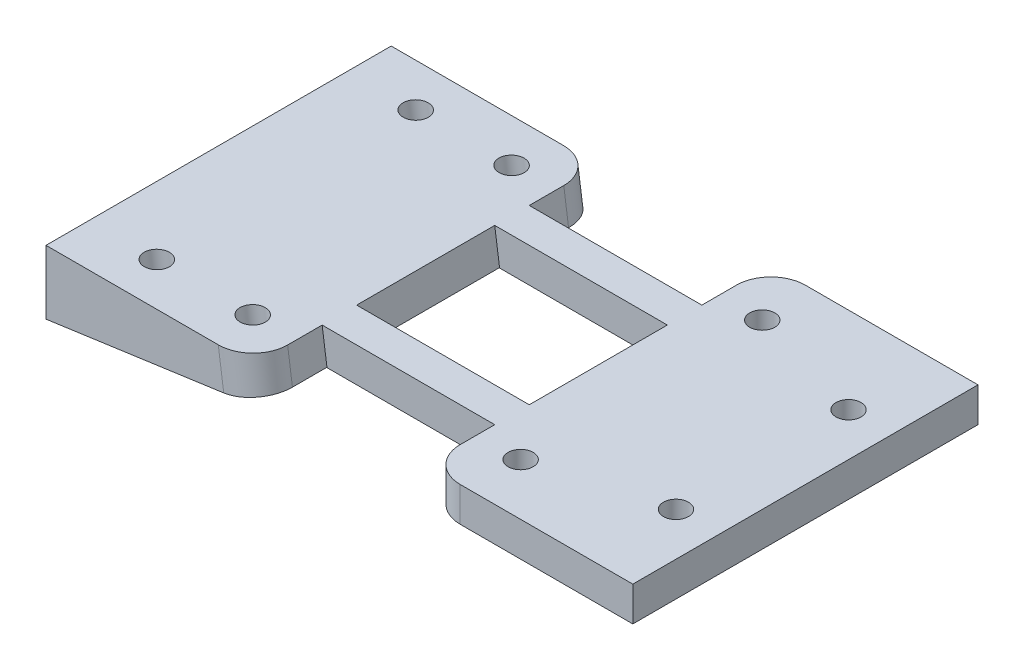
ISO-10303-21;
HEADER;
FILE_DESCRIPTION(('STEP AP214'),'2;1');
FILE_NAME('part.step','',(''),(''),'','','');
FILE_SCHEMA(('AUTOMOTIVE_DESIGN { 1 0 10303 214 1 1 1 1 }'));
ENDSEC;
DATA;
#1=APPLICATION_CONTEXT('core data for automotive mechanical design processes');
#2=APPLICATION_PROTOCOL_DEFINITION('international standard','automotive_design',2000,#1);
#3=PRODUCT_CONTEXT('',#1,'mechanical');
#4=PRODUCT('Part','Part','',(#3));
#5=PRODUCT_RELATED_PRODUCT_CATEGORY('part','',(#4));
#6=PRODUCT_DEFINITION_FORMATION('','',#4);
#7=PRODUCT_DEFINITION_CONTEXT('part definition',#1,'design');
#8=PRODUCT_DEFINITION('design','',#6,#7);
#9=PRODUCT_DEFINITION_SHAPE('','',#8);
#10=(LENGTH_UNIT() NAMED_UNIT(*) SI_UNIT(.MILLI.,.METRE.));
#11=(NAMED_UNIT(*) PLANE_ANGLE_UNIT() SI_UNIT($,.RADIAN.));
#12=(NAMED_UNIT(*) SI_UNIT($,.STERADIAN.) SOLID_ANGLE_UNIT());
#13=UNCERTAINTY_MEASURE_WITH_UNIT(LENGTH_MEASURE(1.E-05),#10,'distance_accuracy_value','');
#14=(GEOMETRIC_REPRESENTATION_CONTEXT(3) GLOBAL_UNCERTAINTY_ASSIGNED_CONTEXT((#13)) GLOBAL_UNIT_ASSIGNED_CONTEXT((#10,
#11,#12)) REPRESENTATION_CONTEXT('',''));
#15=CARTESIAN_POINT('',(0.,0.,0.));
#16=DIRECTION('',(0.,0.,1.));
#17=DIRECTION('',(1.,0.,0.));
#18=AXIS2_PLACEMENT_3D('',#15,#16,#17);
#19=CARTESIAN_POINT('',(17.,-1.99999999999991,10.));
#20=DIRECTION('',(0.,1.,0.));
#21=DIRECTION('',(-1.,0.,0.));
#22=AXIS2_PLACEMENT_3D('',#19,#20,#21);
#23=PLANE('',#22);
#24=CARTESIAN_POINT('',(14.5,-1.99999999999993,5.));
#25=DIRECTION('',(0.,1.,0.));
#26=DIRECTION('',(1.,0.,0.));
#27=AXIS2_PLACEMENT_3D('',#24,#25,#26);
#28=CIRCLE('',#27,0.725);
#29=CARTESIAN_POINT('',(15.225,-1.99999999999993,5.));
#30=VERTEX_POINT('',#29);
#31=EDGE_CURVE('E744',#30,#30,#28,.T.);
#32=ORIENTED_EDGE('',*,*,#31,.T.);
#33=EDGE_LOOP('',(#32));
#34=FACE_BOUND('',#33,.T.);
#35=CARTESIAN_POINT('',(7.50000000000001,-1.99999999999998,-7.));
#36=DIRECTION('',(0.,1.,0.));
#37=DIRECTION('',(-1.,0.,0.));
#38=AXIS2_PLACEMENT_3D('',#35,#36,#37);
#39=CIRCLE('',#38,0.724999999999999);
#40=CARTESIAN_POINT('',(6.77500000000002,-1.99999999999999,-7.));
#41=VERTEX_POINT('',#40);
#42=EDGE_CURVE('E219',#41,#41,#39,.T.);
#43=ORIENTED_EDGE('',*,*,#42,.T.);
#44=EDGE_LOOP('',(#43));
#45=FACE_BOUND('',#44,.T.);
#46=DIRECTION('',(1.,0.,0.));
#47=VECTOR('',#46,1.);
#48=CARTESIAN_POINT('',(17.,-1.99999999999991,10.));
#49=LINE('',#48,#47);
#50=CARTESIAN_POINT('',(7.00000000000002,-1.99999999999999,10.));
#51=VERTEX_POINT('',#50);
#52=CARTESIAN_POINT('',(17.,-1.99999999999991,10.));
#53=VERTEX_POINT('',#52);
#54=EDGE_CURVE('E284',#51,#53,#49,.T.);
#55=ORIENTED_EDGE('',*,*,#54,.F.);
#56=CARTESIAN_POINT('',(7.00000000000002,-1.99999999999999,8.));
#57=DIRECTION('',(0.,1.,0.));
#58=DIRECTION('',(-1.,0.,0.));
#59=AXIS2_PLACEMENT_3D('',#56,#57,#58);
#60=CIRCLE('',#59,2.);
#61=CARTESIAN_POINT('',(5.00000000000002,-2.,8.));
#62=VERTEX_POINT('',#61);
#63=EDGE_CURVE('E323',#51,#62,#60,.F.);
#64=ORIENTED_EDGE('',*,*,#63,.T.);
#65=DIRECTION('',(0.,0.,-1.));
#66=VECTOR('',#65,1.);
#67=CARTESIAN_POINT('',(5.00000000000002,-2.,10.));
#68=LINE('',#67,#66);
#69=CARTESIAN_POINT('',(5.00000000000002,-2.,6.));
#70=VERTEX_POINT('',#69);
#71=EDGE_CURVE('E307',#62,#70,#68,.T.);
#72=ORIENTED_EDGE('',*,*,#71,.T.);
#73=DIRECTION('',(-1.,0.,0.));
#74=VECTOR('',#73,1.);
#75=CARTESIAN_POINT('',(6.,-2.,6.));
#76=LINE('',#75,#74);
#77=CARTESIAN_POINT('',(-4.860146376113,-2.,6.));
#78=VERTEX_POINT('',#77);
#79=EDGE_CURVE('E216',#70,#78,#76,.T.);
#80=ORIENTED_EDGE('',*,*,#79,.T.);
#81=DIRECTION('',(0.,0.,-1.));
#82=VECTOR('',#81,1.);
#83=CARTESIAN_POINT('',(-4.860146376113,-2.,10.));
#84=LINE('',#83,#82);
#85=CARTESIAN_POINT('',(-4.860146376113,-2.,4.));
#86=VERTEX_POINT('',#85);
#87=EDGE_CURVE('E315',#78,#86,#84,.T.);
#88=ORIENTED_EDGE('',*,*,#87,.T.);
#89=DIRECTION('',(-1.,0.,0.));
#90=VECTOR('',#89,1.);
#91=CARTESIAN_POINT('',(6.,-2.,4.));
#92=LINE('',#91,#90);
#93=CARTESIAN_POINT('',(5.00000000000001,-2.,4.));
#94=VERTEX_POINT('',#93);
#95=EDGE_CURVE('E213',#94,#86,#92,.T.);
#96=ORIENTED_EDGE('',*,*,#95,.F.);
#97=CARTESIAN_POINT('',(5.00000000000002,-2.,-4.));
#98=VERTEX_POINT('',#97);
#99=EDGE_CURVE('E309',#94,#98,#68,.T.);
#100=ORIENTED_EDGE('',*,*,#99,.T.);
#101=DIRECTION('',(-1.,0.,0.));
#102=VECTOR('',#101,1.);
#103=CARTESIAN_POINT('',(6.,-2.,-4.));
#104=LINE('',#103,#102);
#105=CARTESIAN_POINT('',(-4.860146376113,-2.,-4.));
#106=VERTEX_POINT('',#105);
#107=EDGE_CURVE('E269',#98,#106,#104,.T.);
#108=ORIENTED_EDGE('',*,*,#107,.T.);
#109=DIRECTION('',(0.,0.,1.));
#110=VECTOR('',#109,1.);
#111=CARTESIAN_POINT('',(-4.8601463761135,-2.00000000000007,10.));
#112=LINE('',#111,#110);
#113=CARTESIAN_POINT('',(-4.8601463761135,-2.00000000000007,-6.));
#114=VERTEX_POINT('',#113);
#115=EDGE_CURVE('E262',#114,#106,#112,.T.);
#116=ORIENTED_EDGE('',*,*,#115,.F.);
#117=DIRECTION('',(-1.,0.,0.));
#118=VECTOR('',#117,1.);
#119=CARTESIAN_POINT('',(6.,-2.,-6.));
#120=LINE('',#119,#118);
#121=CARTESIAN_POINT('',(5.00000000000002,-2.,-6.));
#122=VERTEX_POINT('',#121);
#123=EDGE_CURVE('E266',#122,#114,#120,.T.);
#124=ORIENTED_EDGE('',*,*,#123,.F.);
#125=CARTESIAN_POINT('',(5.00000000000002,-2.,-8.));
#126=VERTEX_POINT('',#125);
#127=EDGE_CURVE('E306',#122,#126,#68,.T.);
#128=ORIENTED_EDGE('',*,*,#127,.T.);
#129=CARTESIAN_POINT('',(7.00000000000002,-1.99999999999999,-8.));
#130=DIRECTION('',(0.,1.,0.));
#131=DIRECTION('',(-1.,0.,0.));
#132=AXIS2_PLACEMENT_3D('',#129,#130,#131);
#133=CIRCLE('',#132,2.);
#134=CARTESIAN_POINT('',(7.00000000000002,-1.99999999999999,-10.));
#135=VERTEX_POINT('',#134);
#136=EDGE_CURVE('E321',#126,#135,#133,.F.);
#137=ORIENTED_EDGE('',*,*,#136,.T.);
#138=DIRECTION('',(1.,0.,0.));
#139=VECTOR('',#138,1.);
#140=CARTESIAN_POINT('',(17.,-1.99999999999991,-10.));
#141=LINE('',#140,#139);
#142=CARTESIAN_POINT('',(17.,-1.99999999999991,-10.));
#143=VERTEX_POINT('',#142);
#144=EDGE_CURVE('E283',#135,#143,#141,.T.);
#145=ORIENTED_EDGE('',*,*,#144,.T.);
#146=DIRECTION('',(0.,0.,-1.));
#147=VECTOR('',#146,1.);
#148=CARTESIAN_POINT('',(17.,-1.99999999999991,10.));
#149=LINE('',#148,#147);
#150=EDGE_CURVE('E303',#53,#143,#149,.T.);
#151=ORIENTED_EDGE('',*,*,#150,.F.);
#152=EDGE_LOOP('',(#55,#64,#72,#80,#88,#96,#100,#108,#116,#124,#128,#137,#145,#151));
#153=FACE_BOUND('',#152,.T.);
#154=CARTESIAN_POINT('',(14.5,-1.99999999999993,-5.));
#155=DIRECTION('',(0.,1.,0.));
#156=DIRECTION('',(-1.,0.,0.));
#157=AXIS2_PLACEMENT_3D('',#154,#155,#156);
#158=CIRCLE('',#157,0.725);
#159=CARTESIAN_POINT('',(13.775,-1.99999999999994,-5.));
#160=VERTEX_POINT('',#159);
#161=EDGE_CURVE('E750',#160,#160,#158,.T.);
#162=ORIENTED_EDGE('',*,*,#161,.T.);
#163=EDGE_LOOP('',(#162));
#164=FACE_BOUND('',#163,.T.);
#165=CARTESIAN_POINT('',(7.50000000000001,-1.99999999999998,7.));
#166=DIRECTION('',(0.,1.,0.));
#167=DIRECTION('',(1.,0.,0.));
#168=AXIS2_PLACEMENT_3D('',#165,#166,#167);
#169=CIRCLE('',#168,0.724999999999999);
#170=CARTESIAN_POINT('',(8.22500000000001,-1.99999999999998,7.));
#171=VERTEX_POINT('',#170);
#172=EDGE_CURVE('E740',#171,#171,#169,.T.);
#173=ORIENTED_EDGE('',*,*,#172,.T.);
#174=EDGE_LOOP('',(#173));
#175=FACE_BOUND('',#174,.T.);
#176=ADVANCED_FACE('F36',(#34,#45,#153,#164,#175),#23,.F.);
#177=CARTESIAN_POINT('',(5.,0.,10.));
#178=DIRECTION('',(0.,-1.,0.));
#179=DIRECTION('',(0.,0.,-1.));
#180=AXIS2_PLACEMENT_3D('',#177,#178,#179);
#181=PLANE('',#180);
#182=CARTESIAN_POINT('',(-7.52456893129654,0.,-7.5));
#183=DIRECTION('',(0.,-1.,0.));
#184=DIRECTION('',(1.,0.,0.));
#185=AXIS2_PLACEMENT_3D('',#182,#183,#184);
#186=ELLIPSE('',#185,0.732124990075997,0.725);
#187=CARTESIAN_POINT('',(-6.79244394122055,0.,-7.5));
#188=VERTEX_POINT('',#187);
#189=EDGE_CURVE('E718',#188,#188,#186,.T.);
#190=ORIENTED_EDGE('',*,*,#189,.T.);
#191=EDGE_LOOP('',(#190));
#192=FACE_BOUND('',#191,.T.);
#193=CARTESIAN_POINT('',(-13.0786205801489,0.,-7.5));
#194=DIRECTION('',(0.,-1.,0.));
#195=DIRECTION('',(1.,0.,0.));
#196=AXIS2_PLACEMENT_3D('',#193,#194,#195);
#197=ELLIPSE('',#196,0.732124990075999,0.725000000000001);
#198=CARTESIAN_POINT('',(-12.3464955900729,0.,-7.5));
#199=VERTEX_POINT('',#198);
#200=EDGE_CURVE('E722',#199,#199,#197,.T.);
#201=ORIENTED_EDGE('',*,*,#200,.T.);
#202=EDGE_LOOP('',(#201));
#203=FACE_BOUND('',#202,.T.);
#204=CARTESIAN_POINT('',(-13.0786205801489,0.,7.5));
#205=DIRECTION('',(0.,-1.,0.));
#206=DIRECTION('',(1.,0.,0.));
#207=AXIS2_PLACEMENT_3D('',#204,#205,#206);
#208=ELLIPSE('',#207,0.732124990075999,0.725000000000001);
#209=CARTESIAN_POINT('',(-12.3464955900729,0.,7.5));
#210=VERTEX_POINT('',#209);
#211=EDGE_CURVE('E731',#210,#210,#208,.T.);
#212=ORIENTED_EDGE('',*,*,#211,.T.);
#213=EDGE_LOOP('',(#212));
#214=FACE_BOUND('',#213,.T.);
#215=CARTESIAN_POINT('',(-7.52456893129654,0.,7.5));
#216=DIRECTION('',(0.,-1.,0.));
#217=DIRECTION('',(1.,0.,0.));
#218=AXIS2_PLACEMENT_3D('',#215,#216,#217);
#219=ELLIPSE('',#218,0.732124990075997,0.725);
#220=CARTESIAN_POINT('',(-6.79244394122055,0.,7.5));
#221=VERTEX_POINT('',#220);
#222=EDGE_CURVE('E737',#221,#221,#219,.T.);
#223=ORIENTED_EDGE('',*,*,#222,.T.);
#224=EDGE_LOOP('',(#223));
#225=FACE_BOUND('',#224,.T.);
#226=CARTESIAN_POINT('',(14.5,2.27682456221956E-13,5.));
#227=DIRECTION('',(0.,1.,0.));
#228=DIRECTION('',(1.,0.,0.));
#229=AXIS2_PLACEMENT_3D('',#226,#227,#228);
#230=CIRCLE('',#229,0.725);
#231=CARTESIAN_POINT('',(15.225,2.32914382225502E-13,5.));
#232=VERTEX_POINT('',#231);
#233=EDGE_CURVE('E747',#232,#232,#230,.T.);
#234=ORIENTED_EDGE('',*,*,#233,.F.);
#235=EDGE_LOOP('',(#234));
#236=FACE_BOUND('',#235,.T.);
#237=CARTESIAN_POINT('',(7.5,1.76941794549634E-13,-7.));
#238=DIRECTION('',(0.,1.,0.));
#239=DIRECTION('',(-1.,0.,0.));
#240=AXIS2_PLACEMENT_3D('',#237,#238,#239);
#241=CIRCLE('',#240,0.724999999999999);
#242=CARTESIAN_POINT('',(6.775,1.71709868546088E-13,-7.));
#243=VERTEX_POINT('',#242);
#244=EDGE_CURVE('E214',#243,#243,#241,.T.);
#245=ORIENTED_EDGE('',*,*,#244,.F.);
#246=EDGE_LOOP('',(#245));
#247=FACE_BOUND('',#246,.T.);
#248=DIRECTION('',(0.,0.,-1.));
#249=VECTOR('',#248,1.);
#250=CARTESIAN_POINT('',(5.,0.,10.));
#251=LINE('',#250,#249);
#252=CARTESIAN_POINT('',(5.,0.,4.));
#253=VERTEX_POINT('',#252);
#254=CARTESIAN_POINT('',(5.,0.,-4.));
#255=VERTEX_POINT('',#254);
#256=EDGE_CURVE('E212',#253,#255,#251,.T.);
#257=ORIENTED_EDGE('',*,*,#256,.F.);
#258=DIRECTION('',(-1.,0.,0.));
#259=VECTOR('',#258,1.);
#260=CARTESIAN_POINT('',(6.,0.,4.));
#261=LINE('',#260,#259);
#262=CARTESIAN_POINT('',(-5.,0.,4.));
#263=VERTEX_POINT('',#262);
#264=EDGE_CURVE('E203',#253,#263,#261,.T.);
#265=ORIENTED_EDGE('',*,*,#264,.T.);
#266=DIRECTION('',(0.,0.,-1.));
#267=VECTOR('',#266,1.);
#268=CARTESIAN_POINT('',(-5.,0.,10.));
#269=LINE('',#268,#267);
#270=CARTESIAN_POINT('',(-5.,0.,-4.));
#271=VERTEX_POINT('',#270);
#272=EDGE_CURVE('E184',#263,#271,#269,.T.);
#273=ORIENTED_EDGE('',*,*,#272,.T.);
#274=DIRECTION('',(-1.,0.,0.));
#275=VECTOR('',#274,1.);
#276=CARTESIAN_POINT('',(6.,0.,-4.));
#277=LINE('',#276,#275);
#278=EDGE_CURVE('E272',#255,#271,#277,.T.);
#279=ORIENTED_EDGE('',*,*,#278,.F.);
#280=EDGE_LOOP('',(#257,#265,#273,#279));
#281=FACE_BOUND('',#280,.T.);
#282=CARTESIAN_POINT('',(-5.,0.,-6.));
#283=VERTEX_POINT('',#282);
#284=CARTESIAN_POINT('',(-5.,0.,-8.));
#285=VERTEX_POINT('',#284);
#286=EDGE_CURVE('E196',#283,#285,#269,.T.);
#287=ORIENTED_EDGE('',*,*,#286,.T.);
#288=CARTESIAN_POINT('',(-7.01965514503723,0.,-8.));
#289=DIRECTION('',(0.,-1.,0.));
#290=DIRECTION('',(-1.,0.,0.));
#291=AXIS2_PLACEMENT_3D('',#288,#289,#290);
#292=ELLIPSE('',#291,2.01965514503723,2.);
#293=CARTESIAN_POINT('',(-7.01965514503723,0.,-10.));
#294=VERTEX_POINT('',#293);
#295=EDGE_CURVE('E341',#285,#294,#292,.F.);
#296=ORIENTED_EDGE('',*,*,#295,.T.);
#297=DIRECTION('',(-1.,0.,0.));
#298=VECTOR('',#297,1.);
#299=CARTESIAN_POINT('',(-5.,0.,-10.));
#300=LINE('',#299,#298);
#301=CARTESIAN_POINT('',(-17.,0.,-10.));
#302=VERTEX_POINT('',#301);
#303=EDGE_CURVE('E248',#294,#302,#300,.T.);
#304=ORIENTED_EDGE('',*,*,#303,.T.);
#305=DIRECTION('',(0.,0.,-1.));
#306=VECTOR('',#305,1.);
#307=CARTESIAN_POINT('',(-17.,0.,10.));
#308=LINE('',#307,#306);
#309=CARTESIAN_POINT('',(-17.,0.,10.));
#310=VERTEX_POINT('',#309);
#311=EDGE_CURVE('E253',#310,#302,#308,.T.);
#312=ORIENTED_EDGE('',*,*,#311,.F.);
#313=DIRECTION('',(-1.,0.,0.));
#314=VECTOR('',#313,1.);
#315=CARTESIAN_POINT('',(-5.,0.,10.));
#316=LINE('',#315,#314);
#317=CARTESIAN_POINT('',(-7.01965514503723,0.,10.));
#318=VERTEX_POINT('',#317);
#319=EDGE_CURVE('E240',#318,#310,#316,.T.);
#320=ORIENTED_EDGE('',*,*,#319,.F.);
#321=CARTESIAN_POINT('',(-7.01965514503723,0.,8.));
#322=DIRECTION('',(0.,-1.,0.));
#323=DIRECTION('',(1.,0.,0.));
#324=AXIS2_PLACEMENT_3D('',#321,#322,#323);
#325=ELLIPSE('',#324,2.01965514503723,2.);
#326=CARTESIAN_POINT('',(-5.,0.,8.));
#327=VERTEX_POINT('',#326);
#328=EDGE_CURVE('E339',#318,#327,#325,.F.);
#329=ORIENTED_EDGE('',*,*,#328,.T.);
#330=CARTESIAN_POINT('',(-5.,0.,6.));
#331=VERTEX_POINT('',#330);
#332=EDGE_CURVE('E195',#327,#331,#269,.T.);
#333=ORIENTED_EDGE('',*,*,#332,.T.);
#334=DIRECTION('',(-1.,0.,0.));
#335=VECTOR('',#334,1.);
#336=CARTESIAN_POINT('',(6.,0.,6.));
#337=LINE('',#336,#335);
#338=CARTESIAN_POINT('',(5.,0.,6.));
#339=VERTEX_POINT('',#338);
#340=EDGE_CURVE('E225',#339,#331,#337,.T.);
#341=ORIENTED_EDGE('',*,*,#340,.F.);
#342=CARTESIAN_POINT('',(5.,0.,8.));
#343=VERTEX_POINT('',#342);
#344=EDGE_CURVE('E298',#343,#339,#251,.T.);
#345=ORIENTED_EDGE('',*,*,#344,.F.);
#346=CARTESIAN_POINT('',(7.,0.,8.));
#347=DIRECTION('',(0.,-1.,0.));
#348=DIRECTION('',(0.,0.,-1.));
#349=AXIS2_PLACEMENT_3D('',#346,#347,#348);
#350=CIRCLE('',#349,2.);
#351=CARTESIAN_POINT('',(7.,0.,10.));
#352=VERTEX_POINT('',#351);
#353=EDGE_CURVE('E329',#343,#352,#350,.F.);
#354=ORIENTED_EDGE('',*,*,#353,.T.);
#355=DIRECTION('',(-1.,0.,0.));
#356=VECTOR('',#355,1.);
#357=CARTESIAN_POINT('',(5.,0.,10.));
#358=LINE('',#357,#356);
#359=CARTESIAN_POINT('',(17.,0.,10.));
#360=VERTEX_POINT('',#359);
#361=EDGE_CURVE('E289',#360,#352,#358,.T.);
#362=ORIENTED_EDGE('',*,*,#361,.F.);
#363=DIRECTION('',(0.,0.,-1.));
#364=VECTOR('',#363,1.);
#365=CARTESIAN_POINT('',(17.,0.,10.));
#366=LINE('',#365,#364);
#367=CARTESIAN_POINT('',(17.,0.,-10.));
#368=VERTEX_POINT('',#367);
#369=EDGE_CURVE('E300',#360,#368,#366,.T.);
#370=ORIENTED_EDGE('',*,*,#369,.T.);
#371=DIRECTION('',(-1.,0.,0.));
#372=VECTOR('',#371,1.);
#373=CARTESIAN_POINT('',(5.,0.,-10.));
#374=LINE('',#373,#372);
#375=CARTESIAN_POINT('',(7.,0.,-10.));
#376=VERTEX_POINT('',#375);
#377=EDGE_CURVE('E287',#368,#376,#374,.T.);
#378=ORIENTED_EDGE('',*,*,#377,.T.);
#379=CARTESIAN_POINT('',(7.,0.,-8.));
#380=DIRECTION('',(0.,-1.,0.));
#381=DIRECTION('',(0.,0.,-1.));
#382=AXIS2_PLACEMENT_3D('',#379,#380,#381);
#383=CIRCLE('',#382,2.);
#384=CARTESIAN_POINT('',(5.,0.,-8.));
#385=VERTEX_POINT('',#384);
#386=EDGE_CURVE('E327',#376,#385,#383,.F.);
#387=ORIENTED_EDGE('',*,*,#386,.T.);
#388=CARTESIAN_POINT('',(5.,0.,-6.));
#389=VERTEX_POINT('',#388);
#390=EDGE_CURVE('E292',#389,#385,#251,.T.);
#391=ORIENTED_EDGE('',*,*,#390,.F.);
#392=DIRECTION('',(-1.,0.,0.));
#393=VECTOR('',#392,1.);
#394=CARTESIAN_POINT('',(6.,0.,-6.));
#395=LINE('',#394,#393);
#396=EDGE_CURVE('E274',#389,#283,#395,.T.);
#397=ORIENTED_EDGE('',*,*,#396,.T.);
#398=EDGE_LOOP('',(#287,#296,#304,#312,#320,#329,#333,#341,#345,#354,#362,#370,#378,#387,#391,#397));
#399=FACE_BOUND('',#398,.T.);
#400=CARTESIAN_POINT('',(14.5,2.27682456221956E-13,-5.));
#401=DIRECTION('',(0.,1.,0.));
#402=DIRECTION('',(-1.,0.,0.));
#403=AXIS2_PLACEMENT_3D('',#400,#401,#402);
#404=CIRCLE('',#403,0.725);
#405=CARTESIAN_POINT('',(13.775,2.2245053021841E-13,-5.));
#406=VERTEX_POINT('',#405);
#407=EDGE_CURVE('E752',#406,#406,#404,.T.);
#408=ORIENTED_EDGE('',*,*,#407,.F.);
#409=EDGE_LOOP('',(#408));
#410=FACE_BOUND('',#409,.T.);
#411=CARTESIAN_POINT('',(7.5,1.76941794549634E-13,7.));
#412=DIRECTION('',(0.,1.,0.));
#413=DIRECTION('',(1.,0.,0.));
#414=AXIS2_PLACEMENT_3D('',#411,#412,#413);
#415=CIRCLE('',#414,0.724999999999999);
#416=CARTESIAN_POINT('',(8.225,1.8217372055318E-13,7.));
#417=VERTEX_POINT('',#416);
#418=EDGE_CURVE('E741',#417,#417,#415,.T.);
#419=ORIENTED_EDGE('',*,*,#418,.F.);
#420=EDGE_LOOP('',(#419));
#421=FACE_BOUND('',#420,.T.);
#422=ADVANCED_FACE('F210',(#192,#203,#214,#225,#236,#247,#281,#399,#410,#421),#181,.F.);
#423=CARTESIAN_POINT('',(5.,0.,10.));
#424=DIRECTION('',(1.,0.,0.));
#425=DIRECTION('',(0.,1.,0.));
#426=AXIS2_PLACEMENT_3D('',#423,#424,#425);
#427=PLANE('',#426);
#428=ORIENTED_EDGE('',*,*,#71,.F.);
#429=DIRECTION('',(0.,-1.,0.));
#430=VECTOR('',#429,1.);
#431=CARTESIAN_POINT('',(5.,0.,8.));
#432=LINE('',#431,#430);
#433=EDGE_CURVE('E325',#62,#343,#432,.F.);
#434=ORIENTED_EDGE('',*,*,#433,.T.);
#435=ORIENTED_EDGE('',*,*,#344,.T.);
#436=DIRECTION('',(0.,1.,0.));
#437=VECTOR('',#436,1.);
#438=CARTESIAN_POINT('',(5.,0.,6.));
#439=LINE('',#438,#437);
#440=EDGE_CURVE('E234',#70,#339,#439,.T.);
#441=ORIENTED_EDGE('',*,*,#440,.F.);
#442=EDGE_LOOP('',(#428,#434,#435,#441));
#443=FACE_BOUND('',#442,.T.);
#444=ADVANCED_FACE('F376',(#443),#427,.F.);
#445=DIRECTION('',(0.,-1.,0.));
#446=VECTOR('',#445,1.);
#447=CARTESIAN_POINT('',(5.,0.,4.));
#448=LINE('',#447,#446);
#449=EDGE_CURVE('E229',#253,#94,#448,.T.);
#450=ORIENTED_EDGE('',*,*,#449,.F.);
#451=ORIENTED_EDGE('',*,*,#256,.T.);
#452=DIRECTION('',(0.,1.,0.));
#453=VECTOR('',#452,1.);
#454=CARTESIAN_POINT('',(5.,0.,-4.));
#455=LINE('',#454,#453);
#456=EDGE_CURVE('E277',#98,#255,#455,.T.);
#457=ORIENTED_EDGE('',*,*,#456,.F.);
#458=ORIENTED_EDGE('',*,*,#99,.F.);
#459=EDGE_LOOP('',(#450,#451,#457,#458));
#460=FACE_BOUND('',#459,.T.);
#461=ADVANCED_FACE('F367',(#460),#427,.F.);
#462=CARTESIAN_POINT('',(-17.,-3.70614516146585,10.));
#463=DIRECTION('',(-0.139173100960059,0.990268068741571,0.));
#464=DIRECTION('',(-0.990268068741571,-0.139173100960059,0.));
#465=AXIS2_PLACEMENT_3D('',#462,#463,#464);
#466=PLANE('',#465);
#467=CARTESIAN_POINT('',(-7.19732396993381,-2.32846888988329,-7.5));
#468=DIRECTION('',(0.139173100960059,-0.990268068741571,0.));
#469=DIRECTION('',(-0.990268068741571,-0.139173100960059,0.));
#470=AXIS2_PLACEMENT_3D('',#467,#468,#469);
#471=CIRCLE('',#470,0.725);
#472=CARTESIAN_POINT('',(-7.91526831977145,-2.42936938807933,-7.5));
#473=VERTEX_POINT('',#472);
#474=EDGE_CURVE('E715',#473,#473,#471,.T.);
#475=ORIENTED_EDGE('',*,*,#474,.F.);
#476=EDGE_LOOP('',(#475));
#477=FACE_BOUND('',#476,.T.);
#478=CARTESIAN_POINT('',(-12.6437983480125,-3.09392094516361,-7.5));
#479=DIRECTION('',(0.139173100960059,-0.990268068741571,0.));
#480=DIRECTION('',(-0.990268068741571,-0.139173100960059,0.));
#481=AXIS2_PLACEMENT_3D('',#478,#479,#480);
#482=CIRCLE('',#481,0.725000000000001);
#483=CARTESIAN_POINT('',(-13.3617426978501,-3.19482144335965,-7.5));
#484=VERTEX_POINT('',#483);
#485=EDGE_CURVE('E719',#484,#484,#482,.T.);
#486=ORIENTED_EDGE('',*,*,#485,.F.);
#487=EDGE_LOOP('',(#486));
#488=FACE_BOUND('',#487,.T.);
#489=CARTESIAN_POINT('',(-12.6437983480125,-3.09392094516361,7.5));
#490=DIRECTION('',(0.139173100960059,-0.990268068741571,0.));
#491=DIRECTION('',(0.990268068741571,0.139173100960059,0.));
#492=AXIS2_PLACEMENT_3D('',#489,#490,#491);
#493=CIRCLE('',#492,0.725000000000001);
#494=CARTESIAN_POINT('',(-11.9258539981748,-2.99302044696757,7.5));
#495=VERTEX_POINT('',#494);
#496=EDGE_CURVE('E728',#495,#495,#493,.T.);
#497=ORIENTED_EDGE('',*,*,#496,.F.);
#498=EDGE_LOOP('',(#497));
#499=FACE_BOUND('',#498,.T.);
#500=CARTESIAN_POINT('',(-7.19732396993381,-2.32846888988329,7.5));
#501=DIRECTION('',(0.139173100960059,-0.990268068741571,0.));
#502=DIRECTION('',(0.990268068741571,0.139173100960059,0.));
#503=AXIS2_PLACEMENT_3D('',#500,#501,#502);
#504=CIRCLE('',#503,0.725);
#505=CARTESIAN_POINT('',(-6.47937962009617,-2.22756839168725,7.5));
#506=VERTEX_POINT('',#505);
#507=EDGE_CURVE('E734',#506,#506,#504,.T.);
#508=ORIENTED_EDGE('',*,*,#507,.F.);
#509=EDGE_LOOP('',(#508));
#510=FACE_BOUND('',#509,.T.);
#511=DIRECTION('',(0.990268068741571,0.139173100960059,0.));
#512=VECTOR('',#511,1.);
#513=CARTESIAN_POINT('',(-17.,-3.70614516146585,-10.));
#514=LINE('',#513,#512);
#515=CARTESIAN_POINT('',(-17.,-3.70614516146585,-10.));
#516=VERTEX_POINT('',#515);
#517=CARTESIAN_POINT('',(-6.70218993556303,-2.25888233940326,-10.));
#518=VERTEX_POINT('',#517);
#519=EDGE_CURVE('E237',#516,#518,#514,.T.);
#520=ORIENTED_EDGE('',*,*,#519,.T.);
#521=CARTESIAN_POINT('',(-6.70218993556302,-2.25888233940326,-8.));
#522=DIRECTION('',(-0.139173100960059,0.990268068741571,0.));
#523=DIRECTION('',(-0.990268068741571,-0.139173100960059,0.));
#524=AXIS2_PLACEMENT_3D('',#521,#522,#523);
#525=CIRCLE('',#524,2.);
#526=CARTESIAN_POINT('',(-4.72165379807988,-1.98053613748314,-8.));
#527=VERTEX_POINT('',#526);
#528=EDGE_CURVE('E346',#518,#527,#525,.F.);
#529=ORIENTED_EDGE('',*,*,#528,.T.);
#530=DIRECTION('',(0.,0.,-1.));
#531=VECTOR('',#530,1.);
#532=CARTESIAN_POINT('',(-4.72165379807988,-1.98053613748314,10.));
#533=LINE('',#532,#531);
#534=CARTESIAN_POINT('',(-4.72165379807988,-1.98053613748314,-6.));
#535=VERTEX_POINT('',#534);
#536=EDGE_CURVE('E256',#535,#527,#533,.T.);
#537=ORIENTED_EDGE('',*,*,#536,.F.);
#538=DIRECTION('',(-0.990268068741571,-0.139173100960059,0.));
#539=VECTOR('',#538,1.);
#540=CARTESIAN_POINT('',(6.06528552958089,-0.464530680489718,-6.));
#541=LINE('',#540,#539);
#542=EDGE_CURVE('E264',#535,#114,#541,.T.);
#543=ORIENTED_EDGE('',*,*,#542,.T.);
#544=ORIENTED_EDGE('',*,*,#115,.T.);
#545=DIRECTION('',(0.990268068741571,0.139173100960059,0.));
#546=VECTOR('',#545,1.);
#547=CARTESIAN_POINT('',(6.06528552958089,-0.464530680489718,-4.));
#548=LINE('',#547,#546);
#549=CARTESIAN_POINT('',(-4.72165379807988,-1.98053613748314,-4.));
#550=VERTEX_POINT('',#549);
#551=EDGE_CURVE('E207',#106,#550,#548,.T.);
#552=ORIENTED_EDGE('',*,*,#551,.T.);
#553=CARTESIAN_POINT('',(-4.72165379807988,-1.98053613748314,4.));
#554=VERTEX_POINT('',#553);
#555=EDGE_CURVE('E260',#554,#550,#533,.T.);
#556=ORIENTED_EDGE('',*,*,#555,.F.);
#557=DIRECTION('',(0.990268068741571,0.139173100960059,0.));
#558=VECTOR('',#557,1.);
#559=CARTESIAN_POINT('',(-17.,-3.70614516146585,4.));
#560=LINE('',#559,#558);
#561=EDGE_CURVE('E205',#86,#554,#560,.T.);
#562=ORIENTED_EDGE('',*,*,#561,.F.);
#563=ORIENTED_EDGE('',*,*,#87,.F.);
#564=DIRECTION('',(-0.990268068741571,-0.139173100960059,0.));
#565=VECTOR('',#564,1.);
#566=CARTESIAN_POINT('',(-17.,-3.70614516146585,6.));
#567=LINE('',#566,#565);
#568=CARTESIAN_POINT('',(-4.72165379807988,-1.98053613748314,6.));
#569=VERTEX_POINT('',#568);
#570=EDGE_CURVE('E231',#569,#78,#567,.T.);
#571=ORIENTED_EDGE('',*,*,#570,.F.);
#572=CARTESIAN_POINT('',(-4.72165379807988,-1.98053613748314,8.));
#573=VERTEX_POINT('',#572);
#574=EDGE_CURVE('E257',#573,#569,#533,.T.);
#575=ORIENTED_EDGE('',*,*,#574,.F.);
#576=CARTESIAN_POINT('',(-6.70218993556302,-2.25888233940326,8.));
#577=DIRECTION('',(-0.139173100960059,0.990268068741571,0.));
#578=DIRECTION('',(-0.990268068741571,-0.139173100960059,0.));
#579=AXIS2_PLACEMENT_3D('',#576,#577,#578);
#580=CIRCLE('',#579,2.);
#581=CARTESIAN_POINT('',(-6.70218993556302,-2.25888233940326,10.));
#582=VERTEX_POINT('',#581);
#583=EDGE_CURVE('E51',#573,#582,#580,.F.);
#584=ORIENTED_EDGE('',*,*,#583,.T.);
#585=DIRECTION('',(0.990268068741571,0.139173100960059,0.));
#586=VECTOR('',#585,1.);
#587=CARTESIAN_POINT('',(-17.,-3.70614516146585,10.));
#588=LINE('',#587,#586);
#589=CARTESIAN_POINT('',(-17.,-3.70614516146585,10.));
#590=VERTEX_POINT('',#589);
#591=EDGE_CURVE('E238',#590,#582,#588,.T.);
#592=ORIENTED_EDGE('',*,*,#591,.F.);
#593=DIRECTION('',(0.,0.,-1.));
#594=VECTOR('',#593,1.);
#595=CARTESIAN_POINT('',(-17.,-3.70614516146585,10.));
#596=LINE('',#595,#594);
#597=EDGE_CURVE('E245',#590,#516,#596,.T.);
#598=ORIENTED_EDGE('',*,*,#597,.T.);
#599=EDGE_LOOP('',(#520,#529,#537,#543,#544,#552,#556,#562,#563,#571,#575,#584,#592,#598));
#600=FACE_BOUND('',#599,.T.);
#601=ADVANCED_FACE('F363',(#477,#488,#499,#510,#600),#466,.F.);
#602=CARTESIAN_POINT('',(-4.72165379807988,-1.98053613748314,10.));
#603=DIRECTION('',(-0.990268068741571,-0.139173100960059,0.));
#604=DIRECTION('',(0.139173100960059,-0.990268068741571,0.));
#605=AXIS2_PLACEMENT_3D('',#602,#603,#604);
#606=PLANE('',#605);
#607=ORIENTED_EDGE('',*,*,#332,.F.);
#608=DIRECTION('',(-0.139173100960059,0.990268068741571,0.));
#609=VECTOR('',#608,1.);
#610=CARTESIAN_POINT('',(-4.72165379807988,-1.98053613748314,8.));
#611=LINE('',#610,#609);
#612=EDGE_CURVE('E12',#327,#573,#611,.F.);
#613=ORIENTED_EDGE('',*,*,#612,.T.);
#614=ORIENTED_EDGE('',*,*,#574,.T.);
#615=DIRECTION('',(0.139173100960059,-0.990268068741571,0.));
#616=VECTOR('',#615,1.);
#617=CARTESIAN_POINT('',(-4.72165379807988,-1.98053613748314,6.));
#618=LINE('',#617,#616);
#619=EDGE_CURVE('E206',#331,#569,#618,.T.);
#620=ORIENTED_EDGE('',*,*,#619,.F.);
#621=EDGE_LOOP('',(#607,#613,#614,#620));
#622=FACE_BOUND('',#621,.T.);
#623=ADVANCED_FACE('F366',(#622),#606,.F.);
#624=DIRECTION('',(-0.139173100960059,0.990268068741571,0.));
#625=VECTOR('',#624,1.);
#626=CARTESIAN_POINT('',(-4.72165379807988,-1.98053613748314,4.));
#627=LINE('',#626,#625);
#628=EDGE_CURVE('E187',#554,#263,#627,.T.);
#629=ORIENTED_EDGE('',*,*,#628,.F.);
#630=ORIENTED_EDGE('',*,*,#555,.T.);
#631=DIRECTION('',(-0.139173100960059,0.990268068741571,0.));
#632=VECTOR('',#631,1.);
#633=CARTESIAN_POINT('',(-4.78693932766077,-1.51600545699343,-4.));
#634=LINE('',#633,#632);
#635=EDGE_CURVE('E190',#550,#271,#634,.T.);
#636=ORIENTED_EDGE('',*,*,#635,.T.);
#637=ORIENTED_EDGE('',*,*,#272,.F.);
#638=EDGE_LOOP('',(#629,#630,#636,#637));
#639=FACE_BOUND('',#638,.T.);
#640=ADVANCED_FACE('F186',(#639),#606,.F.);
#641=CARTESIAN_POINT('',(6.,0.,-6.));
#642=DIRECTION('',(0.,0.,1.));
#643=DIRECTION('',(1.,0.,0.));
#644=AXIS2_PLACEMENT_3D('',#641,#642,#643);
#645=PLANE('',#644);
#646=ORIENTED_EDGE('',*,*,#542,.F.);
#647=DIRECTION('',(0.139173100960059,-0.990268068741571,0.));
#648=VECTOR('',#647,1.);
#649=CARTESIAN_POINT('',(-4.78693932766077,-1.51600545699343,-6.));
#650=LINE('',#649,#648);
#651=EDGE_CURVE('E259',#283,#535,#650,.T.);
#652=ORIENTED_EDGE('',*,*,#651,.F.);
#653=ORIENTED_EDGE('',*,*,#396,.F.);
#654=DIRECTION('',(0.,-1.,0.));
#655=VECTOR('',#654,1.);
#656=CARTESIAN_POINT('',(5.,0.,-6.));
#657=LINE('',#656,#655);
#658=EDGE_CURVE('E280',#389,#122,#657,.T.);
#659=ORIENTED_EDGE('',*,*,#658,.T.);
#660=ORIENTED_EDGE('',*,*,#123,.T.);
#661=EDGE_LOOP('',(#646,#652,#653,#659,#660));
#662=FACE_BOUND('',#661,.T.);
#663=ADVANCED_FACE('F463',(#662),#645,.F.);
#664=CARTESIAN_POINT('',(6.,0.,-4.));
#665=DIRECTION('',(0.,0.,-1.));
#666=DIRECTION('',(-1.,0.,0.));
#667=AXIS2_PLACEMENT_3D('',#664,#665,#666);
#668=PLANE('',#667);
#669=ORIENTED_EDGE('',*,*,#551,.F.);
#670=ORIENTED_EDGE('',*,*,#107,.F.);
#671=ORIENTED_EDGE('',*,*,#456,.T.);
#672=ORIENTED_EDGE('',*,*,#278,.T.);
#673=ORIENTED_EDGE('',*,*,#635,.F.);
#674=EDGE_LOOP('',(#669,#670,#671,#672,#673));
#675=FACE_BOUND('',#674,.T.);
#676=ADVANCED_FACE('F397',(#675),#668,.F.);
#677=ORIENTED_EDGE('',*,*,#390,.T.);
#678=DIRECTION('',(0.,-1.,0.));
#679=VECTOR('',#678,1.);
#680=CARTESIAN_POINT('',(5.00000000000002,-2.,-8.));
#681=LINE('',#680,#679);
#682=EDGE_CURVE('E331',#385,#126,#681,.T.);
#683=ORIENTED_EDGE('',*,*,#682,.T.);
#684=ORIENTED_EDGE('',*,*,#127,.F.);
#685=ORIENTED_EDGE('',*,*,#658,.F.);
#686=EDGE_LOOP('',(#677,#683,#684,#685));
#687=FACE_BOUND('',#686,.T.);
#688=ADVANCED_FACE('F379',(#687),#427,.F.);
#689=CARTESIAN_POINT('',(17.,0.,10.));
#690=DIRECTION('',(-1.,0.,0.));
#691=DIRECTION('',(0.,-1.,0.));
#692=AXIS2_PLACEMENT_3D('',#689,#690,#691);
#693=PLANE('',#692);
#694=DIRECTION('',(0.,1.,0.));
#695=VECTOR('',#694,1.);
#696=CARTESIAN_POINT('',(17.,0.,-10.));
#697=LINE('',#696,#695);
#698=EDGE_CURVE('E294',#143,#368,#697,.T.);
#699=ORIENTED_EDGE('',*,*,#698,.T.);
#700=ORIENTED_EDGE('',*,*,#369,.F.);
#701=DIRECTION('',(0.,1.,0.));
#702=VECTOR('',#701,1.);
#703=CARTESIAN_POINT('',(17.,0.,10.));
#704=LINE('',#703,#702);
#705=EDGE_CURVE('E286',#53,#360,#704,.T.);
#706=ORIENTED_EDGE('',*,*,#705,.F.);
#707=ORIENTED_EDGE('',*,*,#150,.T.);
#708=EDGE_LOOP('',(#699,#700,#706,#707));
#709=FACE_BOUND('',#708,.T.);
#710=ADVANCED_FACE('F394',(#709),#693,.F.);
#711=CARTESIAN_POINT('',(0.,0.,10.));
#712=DIRECTION('',(0.,0.,-1.));
#713=DIRECTION('',(-1.,0.,0.));
#714=AXIS2_PLACEMENT_3D('',#711,#712,#713);
#715=PLANE('',#714);
#716=ORIENTED_EDGE('',*,*,#361,.T.);
#717=DIRECTION('',(0.,-1.,0.));
#718=VECTOR('',#717,1.);
#719=CARTESIAN_POINT('',(7.,0.,10.));
#720=LINE('',#719,#718);
#721=EDGE_CURVE('E318',#352,#51,#720,.T.);
#722=ORIENTED_EDGE('',*,*,#721,.T.);
#723=ORIENTED_EDGE('',*,*,#54,.T.);
#724=ORIENTED_EDGE('',*,*,#705,.T.);
#725=EDGE_LOOP('',(#716,#722,#723,#724));
#726=FACE_BOUND('',#725,.T.);
#727=ADVANCED_FACE('F450',(#726),#715,.F.);
#728=CARTESIAN_POINT('',(0.,0.,-10.));
#729=DIRECTION('',(0.,0.,-1.));
#730=DIRECTION('',(-1.,0.,0.));
#731=AXIS2_PLACEMENT_3D('',#728,#729,#730);
#732=PLANE('',#731);
#733=ORIENTED_EDGE('',*,*,#144,.F.);
#734=DIRECTION('',(0.,-1.,0.));
#735=VECTOR('',#734,1.);
#736=CARTESIAN_POINT('',(7.,0.,-10.));
#737=LINE('',#736,#735);
#738=EDGE_CURVE('E334',#135,#376,#737,.F.);
#739=ORIENTED_EDGE('',*,*,#738,.T.);
#740=ORIENTED_EDGE('',*,*,#377,.F.);
#741=ORIENTED_EDGE('',*,*,#698,.F.);
#742=EDGE_LOOP('',(#733,#739,#740,#741));
#743=FACE_BOUND('',#742,.T.);
#744=ADVANCED_FACE('F440',(#743),#732,.T.);
#745=ORIENTED_EDGE('',*,*,#536,.T.);
#746=DIRECTION('',(-0.139173100960059,0.990268068741571,0.));
#747=VECTOR('',#746,1.);
#748=CARTESIAN_POINT('',(-4.72165379807988,-1.98053613748314,-8.));
#749=LINE('',#748,#747);
#750=EDGE_CURVE('E336',#527,#285,#749,.T.);
#751=ORIENTED_EDGE('',*,*,#750,.T.);
#752=ORIENTED_EDGE('',*,*,#286,.F.);
#753=ORIENTED_EDGE('',*,*,#651,.T.);
#754=EDGE_LOOP('',(#745,#751,#752,#753));
#755=FACE_BOUND('',#754,.T.);
#756=ADVANCED_FACE('F375',(#755),#606,.F.);
#757=CARTESIAN_POINT('',(-17.,0.,10.));
#758=DIRECTION('',(1.,0.,0.));
#759=DIRECTION('',(0.,0.,-1.));
#760=AXIS2_PLACEMENT_3D('',#757,#758,#759);
#761=PLANE('',#760);
#762=DIRECTION('',(0.,-1.,0.));
#763=VECTOR('',#762,1.);
#764=CARTESIAN_POINT('',(-17.,0.,-10.));
#765=LINE('',#764,#763);
#766=EDGE_CURVE('E241',#302,#516,#765,.T.);
#767=ORIENTED_EDGE('',*,*,#766,.T.);
#768=ORIENTED_EDGE('',*,*,#597,.F.);
#769=DIRECTION('',(0.,-1.,0.));
#770=VECTOR('',#769,1.);
#771=CARTESIAN_POINT('',(-17.,0.,10.));
#772=LINE('',#771,#770);
#773=EDGE_CURVE('E243',#310,#590,#772,.T.);
#774=ORIENTED_EDGE('',*,*,#773,.F.);
#775=ORIENTED_EDGE('',*,*,#311,.T.);
#776=EDGE_LOOP('',(#767,#768,#774,#775));
#777=FACE_BOUND('',#776,.T.);
#778=ADVANCED_FACE('F361',(#777),#761,.F.);
#779=CARTESIAN_POINT('',(0.,0.,10.));
#780=DIRECTION('',(0.,0.,1.));
#781=DIRECTION('',(1.,0.,0.));
#782=AXIS2_PLACEMENT_3D('',#779,#780,#781);
#783=PLANE('',#782);
#784=ORIENTED_EDGE('',*,*,#591,.T.);
#785=DIRECTION('',(-0.139173100960059,0.990268068741571,0.));
#786=VECTOR('',#785,1.);
#787=CARTESIAN_POINT('',(-6.98053613748314,-0.278346201920118,10.));
#788=LINE('',#787,#786);
#789=EDGE_CURVE('E44',#582,#318,#788,.T.);
#790=ORIENTED_EDGE('',*,*,#789,.T.);
#791=ORIENTED_EDGE('',*,*,#319,.T.);
#792=ORIENTED_EDGE('',*,*,#773,.T.);
#793=EDGE_LOOP('',(#784,#790,#791,#792));
#794=FACE_BOUND('',#793,.T.);
#795=ADVANCED_FACE('F351',(#794),#783,.T.);
#796=CARTESIAN_POINT('',(0.,0.,-10.));
#797=DIRECTION('',(0.,0.,1.));
#798=DIRECTION('',(1.,0.,0.));
#799=AXIS2_PLACEMENT_3D('',#796,#797,#798);
#800=PLANE('',#799);
#801=ORIENTED_EDGE('',*,*,#303,.F.);
#802=DIRECTION('',(-0.139173100960059,0.990268068741571,0.));
#803=VECTOR('',#802,1.);
#804=CARTESIAN_POINT('',(-6.88369037732895,-0.967439591462585,-10.));
#805=LINE('',#804,#803);
#806=EDGE_CURVE('E343',#294,#518,#805,.F.);
#807=ORIENTED_EDGE('',*,*,#806,.T.);
#808=ORIENTED_EDGE('',*,*,#519,.F.);
#809=ORIENTED_EDGE('',*,*,#766,.F.);
#810=EDGE_LOOP('',(#801,#807,#808,#809));
#811=FACE_BOUND('',#810,.T.);
#812=ADVANCED_FACE('F465',(#811),#800,.F.);
#813=CARTESIAN_POINT('',(6.,0.,6.));
#814=DIRECTION('',(0.,0.,-1.));
#815=DIRECTION('',(-1.,0.,0.));
#816=AXIS2_PLACEMENT_3D('',#813,#814,#815);
#817=PLANE('',#816);
#818=ORIENTED_EDGE('',*,*,#79,.F.);
#819=ORIENTED_EDGE('',*,*,#440,.T.);
#820=ORIENTED_EDGE('',*,*,#340,.T.);
#821=ORIENTED_EDGE('',*,*,#619,.T.);
#822=ORIENTED_EDGE('',*,*,#570,.T.);
#823=EDGE_LOOP('',(#818,#819,#820,#821,#822));
#824=FACE_BOUND('',#823,.T.);
#825=ADVANCED_FACE('F458',(#824),#817,.F.);
#826=CARTESIAN_POINT('',(6.,0.,4.));
#827=DIRECTION('',(0.,0.,1.));
#828=DIRECTION('',(1.,0.,0.));
#829=AXIS2_PLACEMENT_3D('',#826,#827,#828);
#830=PLANE('',#829);
#831=ORIENTED_EDGE('',*,*,#264,.F.);
#832=ORIENTED_EDGE('',*,*,#449,.T.);
#833=ORIENTED_EDGE('',*,*,#95,.T.);
#834=ORIENTED_EDGE('',*,*,#561,.T.);
#835=ORIENTED_EDGE('',*,*,#628,.T.);
#836=EDGE_LOOP('',(#831,#832,#833,#834,#835));
#837=FACE_BOUND('',#836,.T.);
#838=ADVANCED_FACE('F201',(#837),#830,.F.);
#839=CARTESIAN_POINT('',(7.5,1.76941794549634E-13,-7.));
#840=DIRECTION('',(0.,-1.,0.));
#841=DIRECTION('',(1.,0.,0.));
#842=AXIS2_PLACEMENT_3D('',#839,#840,#841);
#843=CYLINDRICAL_SURFACE('',#842,0.724999999999999);
#844=ORIENTED_EDGE('',*,*,#244,.T.);
#845=EDGE_LOOP('',(#844));
#846=FACE_BOUND('',#845,.T.);
#847=ORIENTED_EDGE('',*,*,#42,.F.);
#848=EDGE_LOOP('',(#847));
#849=FACE_BOUND('',#848,.T.);
#850=ADVANCED_FACE('F531',(#846,#849),#843,.F.);
#851=CARTESIAN_POINT('',(14.5,2.27682456221956E-13,-5.));
#852=DIRECTION('',(0.,-1.,0.));
#853=DIRECTION('',(1.,0.,0.));
#854=AXIS2_PLACEMENT_3D('',#851,#852,#853);
#855=CYLINDRICAL_SURFACE('',#854,0.725);
#856=ORIENTED_EDGE('',*,*,#407,.T.);
#857=EDGE_LOOP('',(#856));
#858=FACE_BOUND('',#857,.T.);
#859=ORIENTED_EDGE('',*,*,#161,.F.);
#860=EDGE_LOOP('',(#859));
#861=FACE_BOUND('',#860,.T.);
#862=ADVANCED_FACE('F541',(#858,#861),#855,.F.);
#863=CARTESIAN_POINT('',(14.5,2.27682456221956E-13,5.));
#864=DIRECTION('',(0.,-1.,0.));
#865=DIRECTION('',(1.,0.,0.));
#866=AXIS2_PLACEMENT_3D('',#863,#864,#865);
#867=CYLINDRICAL_SURFACE('',#866,0.725);
#868=ORIENTED_EDGE('',*,*,#233,.T.);
#869=EDGE_LOOP('',(#868));
#870=FACE_BOUND('',#869,.T.);
#871=ORIENTED_EDGE('',*,*,#31,.F.);
#872=EDGE_LOOP('',(#871));
#873=FACE_BOUND('',#872,.T.);
#874=ADVANCED_FACE('F552',(#870,#873),#867,.F.);
#875=CARTESIAN_POINT('',(7.5,1.76941794549634E-13,7.));
#876=DIRECTION('',(0.,-1.,0.));
#877=DIRECTION('',(1.,0.,0.));
#878=AXIS2_PLACEMENT_3D('',#875,#876,#877);
#879=CYLINDRICAL_SURFACE('',#878,0.724999999999999);
#880=ORIENTED_EDGE('',*,*,#418,.T.);
#881=EDGE_LOOP('',(#880));
#882=FACE_BOUND('',#881,.T.);
#883=ORIENTED_EDGE('',*,*,#172,.F.);
#884=EDGE_LOOP('',(#883));
#885=FACE_BOUND('',#884,.T.);
#886=ADVANCED_FACE('F562',(#882,#885),#879,.F.);
#887=CARTESIAN_POINT('',(-7.70809999622403,1.305891382502,7.5));
#888=DIRECTION('',(0.139173100960059,-0.990268068741571,0.));
#889=DIRECTION('',(0.990268068741571,0.139173100960059,0.));
#890=AXIS2_PLACEMENT_3D('',#887,#888,#889);
#891=CYLINDRICAL_SURFACE('',#890,0.725);
#892=ORIENTED_EDGE('',*,*,#507,.T.);
#893=EDGE_LOOP('',(#892));
#894=FACE_BOUND('',#893,.T.);
#895=ORIENTED_EDGE('',*,*,#222,.F.);
#896=EDGE_LOOP('',(#895));
#897=FACE_BOUND('',#896,.T.);
#898=ADVANCED_FACE('F572',(#894,#897),#891,.F.);
#899=CARTESIAN_POINT('',(-13.1545743743027,0.540439327221676,7.5));
#900=DIRECTION('',(0.139173100960059,-0.990268068741571,0.));
#901=DIRECTION('',(0.990268068741571,0.139173100960059,0.));
#902=AXIS2_PLACEMENT_3D('',#899,#900,#901);
#903=CYLINDRICAL_SURFACE('',#902,0.725000000000001);
#904=ORIENTED_EDGE('',*,*,#496,.T.);
#905=EDGE_LOOP('',(#904));
#906=FACE_BOUND('',#905,.T.);
#907=ORIENTED_EDGE('',*,*,#211,.F.);
#908=EDGE_LOOP('',(#907));
#909=FACE_BOUND('',#908,.T.);
#910=ADVANCED_FACE('F582',(#906,#909),#903,.F.);
#911=CARTESIAN_POINT('',(-13.1545743743027,0.540439327221676,-7.5));
#912=DIRECTION('',(0.139173100960059,-0.990268068741571,0.));
#913=DIRECTION('',(0.990268068741571,0.139173100960059,0.));
#914=AXIS2_PLACEMENT_3D('',#911,#912,#913);
#915=CYLINDRICAL_SURFACE('',#914,0.725000000000001);
#916=ORIENTED_EDGE('',*,*,#485,.T.);
#917=EDGE_LOOP('',(#916));
#918=FACE_BOUND('',#917,.T.);
#919=ORIENTED_EDGE('',*,*,#200,.F.);
#920=EDGE_LOOP('',(#919));
#921=FACE_BOUND('',#920,.T.);
#922=ADVANCED_FACE('F592',(#918,#921),#915,.F.);
#923=CARTESIAN_POINT('',(-7.70809999622403,1.305891382502,-7.5));
#924=DIRECTION('',(0.139173100960059,-0.990268068741571,0.));
#925=DIRECTION('',(0.990268068741571,0.139173100960059,0.));
#926=AXIS2_PLACEMENT_3D('',#923,#924,#925);
#927=CYLINDRICAL_SURFACE('',#926,0.725);
#928=ORIENTED_EDGE('',*,*,#474,.T.);
#929=EDGE_LOOP('',(#928));
#930=FACE_BOUND('',#929,.T.);
#931=ORIENTED_EDGE('',*,*,#189,.F.);
#932=EDGE_LOOP('',(#931));
#933=FACE_BOUND('',#932,.T.);
#934=ADVANCED_FACE('F403',(#930,#933),#927,.F.);
#935=CARTESIAN_POINT('',(7.,0.,8.));
#936=DIRECTION('',(0.,-1.,0.));
#937=DIRECTION('',(1.,0.,0.));
#938=AXIS2_PLACEMENT_3D('',#935,#936,#937);
#939=CYLINDRICAL_SURFACE('',#938,2.);
#940=ORIENTED_EDGE('',*,*,#353,.F.);
#941=ORIENTED_EDGE('',*,*,#433,.F.);
#942=ORIENTED_EDGE('',*,*,#63,.F.);
#943=ORIENTED_EDGE('',*,*,#721,.F.);
#944=EDGE_LOOP('',(#940,#941,#942,#943));
#945=FACE_BOUND('',#944,.T.);
#946=ADVANCED_FACE('F399',(#945),#939,.T.);
#947=CARTESIAN_POINT('',(7.,0.,-8.));
#948=DIRECTION('',(0.,1.,0.));
#949=DIRECTION('',(-1.,0.,0.));
#950=AXIS2_PLACEMENT_3D('',#947,#948,#949);
#951=CYLINDRICAL_SURFACE('',#950,2.);
#952=ORIENTED_EDGE('',*,*,#386,.F.);
#953=ORIENTED_EDGE('',*,*,#738,.F.);
#954=ORIENTED_EDGE('',*,*,#136,.F.);
#955=ORIENTED_EDGE('',*,*,#682,.F.);
#956=EDGE_LOOP('',(#952,#953,#954,#955));
#957=FACE_BOUND('',#956,.T.);
#958=ADVANCED_FACE('F402',(#957),#951,.T.);
#959=CARTESIAN_POINT('',(-6.70218993556302,-2.25888233940326,-8.));
#960=DIRECTION('',(-0.139173100960059,0.990268068741571,0.));
#961=DIRECTION('',(-0.990268068741571,-0.139173100960059,0.));
#962=AXIS2_PLACEMENT_3D('',#959,#960,#961);
#963=CYLINDRICAL_SURFACE('',#962,2.);
#964=ORIENTED_EDGE('',*,*,#528,.F.);
#965=ORIENTED_EDGE('',*,*,#806,.F.);
#966=ORIENTED_EDGE('',*,*,#295,.F.);
#967=ORIENTED_EDGE('',*,*,#750,.F.);
#968=EDGE_LOOP('',(#964,#965,#966,#967));
#969=FACE_BOUND('',#968,.T.);
#970=ADVANCED_FACE('F406',(#969),#963,.T.);
#971=CARTESIAN_POINT('',(-6.88369037732895,-0.967439591462585,8.));
#972=DIRECTION('',(0.139173100960059,-0.990268068741571,0.));
#973=DIRECTION('',(0.990268068741571,0.139173100960059,0.));
#974=AXIS2_PLACEMENT_3D('',#971,#972,#973);
#975=CYLINDRICAL_SURFACE('',#974,2.);
#976=ORIENTED_EDGE('',*,*,#583,.F.);
#977=ORIENTED_EDGE('',*,*,#612,.F.);
#978=ORIENTED_EDGE('',*,*,#328,.F.);
#979=ORIENTED_EDGE('',*,*,#789,.F.);
#980=EDGE_LOOP('',(#976,#977,#978,#979));
#981=FACE_BOUND('',#980,.T.);
#982=ADVANCED_FACE('F38',(#981),#975,.T.);
#983=CLOSED_SHELL('',(#176,#422,#444,#461,#601,#623,#640,#663,#676,#688,#710,#727,#744,#756,
#778,#795,#812,#825,#838,#850,#862,#874,#886,#898,#910,#922,#934,#946,#958,#970,#982));
#984=MANIFOLD_SOLID_BREP('B2',#983);
#985=ADVANCED_BREP_SHAPE_REPRESENTATION('',(#18,#984),#14);
#986=SHAPE_DEFINITION_REPRESENTATION(#9,#985);
ENDSEC;
END-ISO-10303-21;
